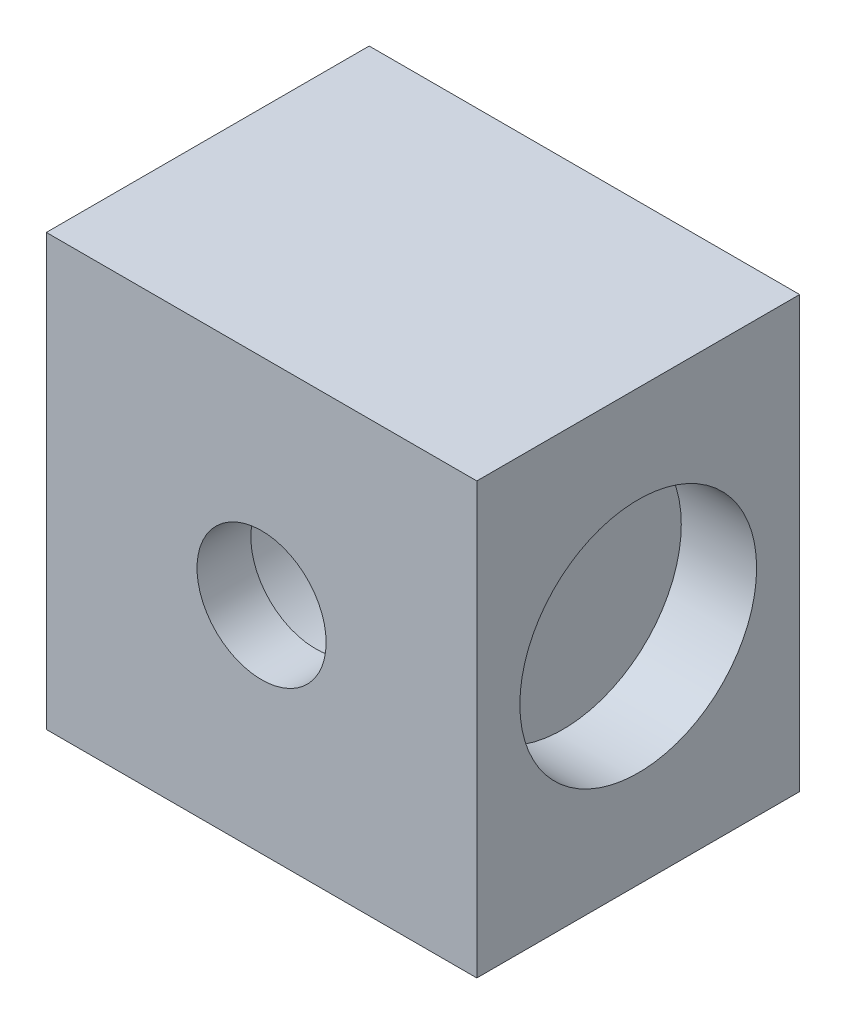
ISO-10303-21;
HEADER;
FILE_DESCRIPTION(('STEP AP214'),'2;1');
FILE_NAME('part.step','',(''),(''),'','','');
FILE_SCHEMA(('AUTOMOTIVE_DESIGN { 1 0 10303 214 1 1 1 1 }'));
ENDSEC;
DATA;
#1=APPLICATION_CONTEXT('core data for automotive mechanical design processes');
#2=APPLICATION_PROTOCOL_DEFINITION('international standard','automotive_design',2000,#1);
#3=PRODUCT_CONTEXT('',#1,'mechanical');
#4=PRODUCT('Part','Part','',(#3));
#5=PRODUCT_RELATED_PRODUCT_CATEGORY('part','',(#4));
#6=PRODUCT_DEFINITION_FORMATION('','',#4);
#7=PRODUCT_DEFINITION_CONTEXT('part definition',#1,'design');
#8=PRODUCT_DEFINITION('design','',#6,#7);
#9=PRODUCT_DEFINITION_SHAPE('','',#8);
#10=(LENGTH_UNIT() NAMED_UNIT(*) SI_UNIT(.MILLI.,.METRE.));
#11=(NAMED_UNIT(*) PLANE_ANGLE_UNIT() SI_UNIT($,.RADIAN.));
#12=(NAMED_UNIT(*) SI_UNIT($,.STERADIAN.) SOLID_ANGLE_UNIT());
#13=UNCERTAINTY_MEASURE_WITH_UNIT(LENGTH_MEASURE(1.E-05),#10,'distance_accuracy_value','');
#14=(GEOMETRIC_REPRESENTATION_CONTEXT(3) GLOBAL_UNCERTAINTY_ASSIGNED_CONTEXT((#13)) GLOBAL_UNIT_ASSIGNED_CONTEXT((#10,
#11,#12)) REPRESENTATION_CONTEXT('',''));
#15=CARTESIAN_POINT('',(0.,0.,0.));
#16=DIRECTION('',(0.,0.,1.));
#17=DIRECTION('',(1.,0.,0.));
#18=AXIS2_PLACEMENT_3D('',#15,#16,#17);
#19=CARTESIAN_POINT('',(-20.,-20.,30.));
#20=DIRECTION('',(1.,0.,0.));
#21=DIRECTION('',(0.,0.,-1.));
#22=AXIS2_PLACEMENT_3D('',#19,#20,#21);
#23=PLANE('',#22);
#24=DIRECTION('',(0.,-1.,0.));
#25=VECTOR('',#24,1.);
#26=CARTESIAN_POINT('',(-20.,-20.,0.));
#27=LINE('',#26,#25);
#28=CARTESIAN_POINT('',(-20.,20.,0.));
#29=VERTEX_POINT('',#28);
#30=CARTESIAN_POINT('',(-20.,-20.,0.));
#31=VERTEX_POINT('',#30);
#32=EDGE_CURVE('E98',#29,#31,#27,.T.);
#33=ORIENTED_EDGE('',*,*,#32,.T.);
#34=DIRECTION('',(0.,0.,-1.));
#35=VECTOR('',#34,1.);
#36=CARTESIAN_POINT('',(-20.,-20.,30.));
#37=LINE('',#36,#35);
#38=CARTESIAN_POINT('',(-20.,-20.,30.));
#39=VERTEX_POINT('',#38);
#40=EDGE_CURVE('E11',#39,#31,#37,.T.);
#41=ORIENTED_EDGE('',*,*,#40,.F.);
#42=DIRECTION('',(0.,-1.,0.));
#43=VECTOR('',#42,1.);
#44=CARTESIAN_POINT('',(-20.,-20.,30.));
#45=LINE('',#44,#43);
#46=CARTESIAN_POINT('',(-20.,20.,30.));
#47=VERTEX_POINT('',#46);
#48=EDGE_CURVE('E86',#47,#39,#45,.T.);
#49=ORIENTED_EDGE('',*,*,#48,.F.);
#50=DIRECTION('',(0.,0.,-1.));
#51=VECTOR('',#50,1.);
#52=CARTESIAN_POINT('',(-20.,20.,30.));
#53=LINE('',#52,#51);
#54=EDGE_CURVE('E94',#47,#29,#53,.T.);
#55=ORIENTED_EDGE('',*,*,#54,.T.);
#56=EDGE_LOOP('',(#33,#41,#49,#55));
#57=FACE_BOUND('',#56,.T.);
#58=ADVANCED_FACE('F35',(#57),#23,.F.);
#59=CARTESIAN_POINT('',(20.,-20.,30.));
#60=DIRECTION('',(0.,1.,0.));
#61=DIRECTION('',(-1.,0.,0.));
#62=AXIS2_PLACEMENT_3D('',#59,#60,#61);
#63=PLANE('',#62);
#64=DIRECTION('',(1.,0.,0.));
#65=VECTOR('',#64,1.);
#66=CARTESIAN_POINT('',(20.,-20.,0.));
#67=LINE('',#66,#65);
#68=CARTESIAN_POINT('',(20.,-20.,0.));
#69=VERTEX_POINT('',#68);
#70=EDGE_CURVE('E90',#31,#69,#67,.T.);
#71=ORIENTED_EDGE('',*,*,#70,.T.);
#72=DIRECTION('',(0.,0.,-1.));
#73=VECTOR('',#72,1.);
#74=CARTESIAN_POINT('',(20.,-20.,30.));
#75=LINE('',#74,#73);
#76=CARTESIAN_POINT('',(20.,-20.,30.));
#77=VERTEX_POINT('',#76);
#78=EDGE_CURVE('E43',#77,#69,#75,.T.);
#79=ORIENTED_EDGE('',*,*,#78,.F.);
#80=DIRECTION('',(1.,0.,0.));
#81=VECTOR('',#80,1.);
#82=CARTESIAN_POINT('',(20.,-20.,30.));
#83=LINE('',#82,#81);
#84=EDGE_CURVE('E81',#39,#77,#83,.T.);
#85=ORIENTED_EDGE('',*,*,#84,.F.);
#86=ORIENTED_EDGE('',*,*,#40,.T.);
#87=EDGE_LOOP('',(#71,#79,#85,#86));
#88=FACE_BOUND('',#87,.T.);
#89=ADVANCED_FACE('F89',(#88),#63,.F.);
#90=CARTESIAN_POINT('',(20.,-20.,30.));
#91=DIRECTION('',(-1.,0.,0.));
#92=DIRECTION('',(0.,0.,1.));
#93=AXIS2_PLACEMENT_3D('',#90,#91,#92);
#94=PLANE('',#93);
#95=CARTESIAN_POINT('',(20.,0.,15.));
#96=DIRECTION('',(1.,0.,0.));
#97=DIRECTION('',(0.,0.,-1.));
#98=AXIS2_PLACEMENT_3D('',#95,#96,#97);
#99=CIRCLE('',#98,11.);
#100=CARTESIAN_POINT('',(20.,0.,4.));
#101=VERTEX_POINT('',#100);
#102=EDGE_CURVE('E112',#101,#101,#99,.T.);
#103=ORIENTED_EDGE('',*,*,#102,.F.);
#104=EDGE_LOOP('',(#103));
#105=FACE_BOUND('',#104,.T.);
#106=DIRECTION('',(0.,1.,0.));
#107=VECTOR('',#106,1.);
#108=CARTESIAN_POINT('',(20.,-20.,0.));
#109=LINE('',#108,#107);
#110=CARTESIAN_POINT('',(20.,20.,0.));
#111=VERTEX_POINT('',#110);
#112=EDGE_CURVE('E68',#69,#111,#109,.T.);
#113=ORIENTED_EDGE('',*,*,#112,.T.);
#114=DIRECTION('',(0.,0.,-1.));
#115=VECTOR('',#114,1.);
#116=CARTESIAN_POINT('',(20.,20.,30.));
#117=LINE('',#116,#115);
#118=CARTESIAN_POINT('',(20.,20.,30.));
#119=VERTEX_POINT('',#118);
#120=EDGE_CURVE('E91',#119,#111,#117,.T.);
#121=ORIENTED_EDGE('',*,*,#120,.F.);
#122=DIRECTION('',(0.,1.,0.));
#123=VECTOR('',#122,1.);
#124=CARTESIAN_POINT('',(20.,-20.,30.));
#125=LINE('',#124,#123);
#126=EDGE_CURVE('E84',#77,#119,#125,.T.);
#127=ORIENTED_EDGE('',*,*,#126,.F.);
#128=ORIENTED_EDGE('',*,*,#78,.T.);
#129=EDGE_LOOP('',(#113,#121,#127,#128));
#130=FACE_BOUND('',#129,.T.);
#131=ADVANCED_FACE('F92',(#105,#130),#94,.F.);
#132=CARTESIAN_POINT('',(20.,20.,30.));
#133=DIRECTION('',(0.,-1.,0.));
#134=DIRECTION('',(1.,0.,0.));
#135=AXIS2_PLACEMENT_3D('',#132,#133,#134);
#136=PLANE('',#135);
#137=DIRECTION('',(-1.,0.,0.));
#138=VECTOR('',#137,1.);
#139=CARTESIAN_POINT('',(20.,20.,0.));
#140=LINE('',#139,#138);
#141=EDGE_CURVE('E74',#111,#29,#140,.T.);
#142=ORIENTED_EDGE('',*,*,#141,.T.);
#143=ORIENTED_EDGE('',*,*,#54,.F.);
#144=DIRECTION('',(-1.,0.,0.));
#145=VECTOR('',#144,1.);
#146=CARTESIAN_POINT('',(20.,20.,30.));
#147=LINE('',#146,#145);
#148=EDGE_CURVE('E51',#119,#47,#147,.T.);
#149=ORIENTED_EDGE('',*,*,#148,.F.);
#150=ORIENTED_EDGE('',*,*,#120,.T.);
#151=EDGE_LOOP('',(#142,#143,#149,#150));
#152=FACE_BOUND('',#151,.T.);
#153=ADVANCED_FACE('F106',(#152),#136,.F.);
#154=CARTESIAN_POINT('',(0.,0.,30.));
#155=DIRECTION('',(0.,0.,1.));
#156=DIRECTION('',(1.,0.,0.));
#157=AXIS2_PLACEMENT_3D('',#154,#155,#156);
#158=PLANE('',#157);
#159=CARTESIAN_POINT('',(0.,0.,30.));
#160=DIRECTION('',(0.,0.,1.));
#161=DIRECTION('',(1.,0.,0.));
#162=AXIS2_PLACEMENT_3D('',#159,#160,#161);
#163=CIRCLE('',#162,6.);
#164=CARTESIAN_POINT('',(6.,0.,30.));
#165=VERTEX_POINT('',#164);
#166=EDGE_CURVE('E115',#165,#165,#163,.T.);
#167=ORIENTED_EDGE('',*,*,#166,.F.);
#168=EDGE_LOOP('',(#167));
#169=FACE_BOUND('',#168,.T.);
#170=ORIENTED_EDGE('',*,*,#48,.T.);
#171=ORIENTED_EDGE('',*,*,#84,.T.);
#172=ORIENTED_EDGE('',*,*,#126,.T.);
#173=ORIENTED_EDGE('',*,*,#148,.T.);
#174=EDGE_LOOP('',(#170,#171,#172,#173));
#175=FACE_BOUND('',#174,.T.);
#176=ADVANCED_FACE('F82',(#169,#175),#158,.T.);
#177=CARTESIAN_POINT('',(0.,0.,0.));
#178=DIRECTION('',(0.,0.,1.));
#179=DIRECTION('',(1.,0.,0.));
#180=AXIS2_PLACEMENT_3D('',#177,#178,#179);
#181=PLANE('',#180);
#182=CARTESIAN_POINT('',(0.,0.,0.));
#183=DIRECTION('',(0.,0.,-1.));
#184=DIRECTION('',(-1.,0.,0.));
#185=AXIS2_PLACEMENT_3D('',#182,#183,#184);
#186=CIRCLE('',#185,10.);
#187=CARTESIAN_POINT('',(-10.,0.,0.));
#188=VERTEX_POINT('',#187);
#189=EDGE_CURVE('E124',#188,#188,#186,.T.);
#190=ORIENTED_EDGE('',*,*,#189,.F.);
#191=EDGE_LOOP('',(#190));
#192=FACE_BOUND('',#191,.T.);
#193=ORIENTED_EDGE('',*,*,#32,.F.);
#194=ORIENTED_EDGE('',*,*,#141,.F.);
#195=ORIENTED_EDGE('',*,*,#112,.F.);
#196=ORIENTED_EDGE('',*,*,#70,.F.);
#197=EDGE_LOOP('',(#193,#194,#195,#196));
#198=FACE_BOUND('',#197,.T.);
#199=ADVANCED_FACE('F109',(#192,#198),#181,.F.);
#200=CARTESIAN_POINT('',(13.,0.,15.));
#201=DIRECTION('',(1.,0.,0.));
#202=DIRECTION('',(0.,0.,-1.));
#203=AXIS2_PLACEMENT_3D('',#200,#201,#202);
#204=CYLINDRICAL_SURFACE('',#203,11.);
#205=CARTESIAN_POINT('',(13.,0.,15.));
#206=DIRECTION('',(1.,0.,0.));
#207=DIRECTION('',(0.,0.,-1.));
#208=AXIS2_PLACEMENT_3D('',#205,#206,#207);
#209=CIRCLE('',#208,11.);
#210=CARTESIAN_POINT('',(13.,0.,4.));
#211=VERTEX_POINT('',#210);
#212=EDGE_CURVE('E101',#211,#211,#209,.T.);
#213=ORIENTED_EDGE('',*,*,#212,.F.);
#214=EDGE_LOOP('',(#213));
#215=FACE_BOUND('',#214,.T.);
#216=ORIENTED_EDGE('',*,*,#102,.T.);
#217=EDGE_LOOP('',(#216));
#218=FACE_BOUND('',#217,.T.);
#219=ADVANCED_FACE('F140',(#215,#218),#204,.F.);
#220=CARTESIAN_POINT('',(13.,0.,15.));
#221=DIRECTION('',(1.,0.,0.));
#222=DIRECTION('',(0.,0.,-1.));
#223=AXIS2_PLACEMENT_3D('',#220,#221,#222);
#224=PLANE('',#223);
#225=ORIENTED_EDGE('',*,*,#212,.T.);
#226=EDGE_LOOP('',(#225));
#227=FACE_BOUND('',#226,.T.);
#228=ADVANCED_FACE('F146',(#227),#224,.T.);
#229=CARTESIAN_POINT('',(0.,0.,25.));
#230=DIRECTION('',(0.,0.,1.));
#231=DIRECTION('',(1.,0.,0.));
#232=AXIS2_PLACEMENT_3D('',#229,#230,#231);
#233=CYLINDRICAL_SURFACE('',#232,6.);
#234=CARTESIAN_POINT('',(0.,0.,25.));
#235=DIRECTION('',(0.,0.,1.));
#236=DIRECTION('',(1.,0.,0.));
#237=AXIS2_PLACEMENT_3D('',#234,#235,#236);
#238=CIRCLE('',#237,6.);
#239=CARTESIAN_POINT('',(6.,0.,25.));
#240=VERTEX_POINT('',#239);
#241=EDGE_CURVE('E120',#240,#240,#238,.T.);
#242=ORIENTED_EDGE('',*,*,#241,.F.);
#243=EDGE_LOOP('',(#242));
#244=FACE_BOUND('',#243,.T.);
#245=ORIENTED_EDGE('',*,*,#166,.T.);
#246=EDGE_LOOP('',(#245));
#247=FACE_BOUND('',#246,.T.);
#248=ADVANCED_FACE('F181',(#244,#247),#233,.F.);
#249=CARTESIAN_POINT('',(0.,0.,25.));
#250=DIRECTION('',(0.,0.,-1.));
#251=DIRECTION('',(-1.,0.,0.));
#252=AXIS2_PLACEMENT_3D('',#249,#250,#251);
#253=PLANE('',#252);
#254=CARTESIAN_POINT('',(0.,0.,25.));
#255=DIRECTION('',(0.,0.,-1.));
#256=DIRECTION('',(-1.,0.,0.));
#257=AXIS2_PLACEMENT_3D('',#254,#255,#256);
#258=CIRCLE('',#257,10.);
#259=CARTESIAN_POINT('',(-10.,0.,25.));
#260=VERTEX_POINT('',#259);
#261=EDGE_CURVE('E123',#260,#260,#258,.T.);
#262=ORIENTED_EDGE('',*,*,#261,.T.);
#263=EDGE_LOOP('',(#262));
#264=FACE_BOUND('',#263,.T.);
#265=ORIENTED_EDGE('',*,*,#241,.T.);
#266=EDGE_LOOP('',(#265));
#267=FACE_BOUND('',#266,.T.);
#268=ADVANCED_FACE('F130',(#264,#267),#253,.T.);
#269=CARTESIAN_POINT('',(0.,0.,25.));
#270=DIRECTION('',(0.,0.,-1.));
#271=DIRECTION('',(-1.,0.,0.));
#272=AXIS2_PLACEMENT_3D('',#269,#270,#271);
#273=CYLINDRICAL_SURFACE('',#272,10.);
#274=ORIENTED_EDGE('',*,*,#261,.F.);
#275=EDGE_LOOP('',(#274));
#276=FACE_BOUND('',#275,.T.);
#277=ORIENTED_EDGE('',*,*,#189,.T.);
#278=EDGE_LOOP('',(#277));
#279=FACE_BOUND('',#278,.T.);
#280=ADVANCED_FACE('F133',(#276,#279),#273,.F.);
#281=CLOSED_SHELL('',(#58,#89,#131,#153,#176,#199,#219,#228,#248,#268,#280));
#282=MANIFOLD_SOLID_BREP('B2',#281);
#283=ADVANCED_BREP_SHAPE_REPRESENTATION('',(#18,#282),#14);
#284=SHAPE_DEFINITION_REPRESENTATION(#9,#283);
ENDSEC;
END-ISO-10303-21;
